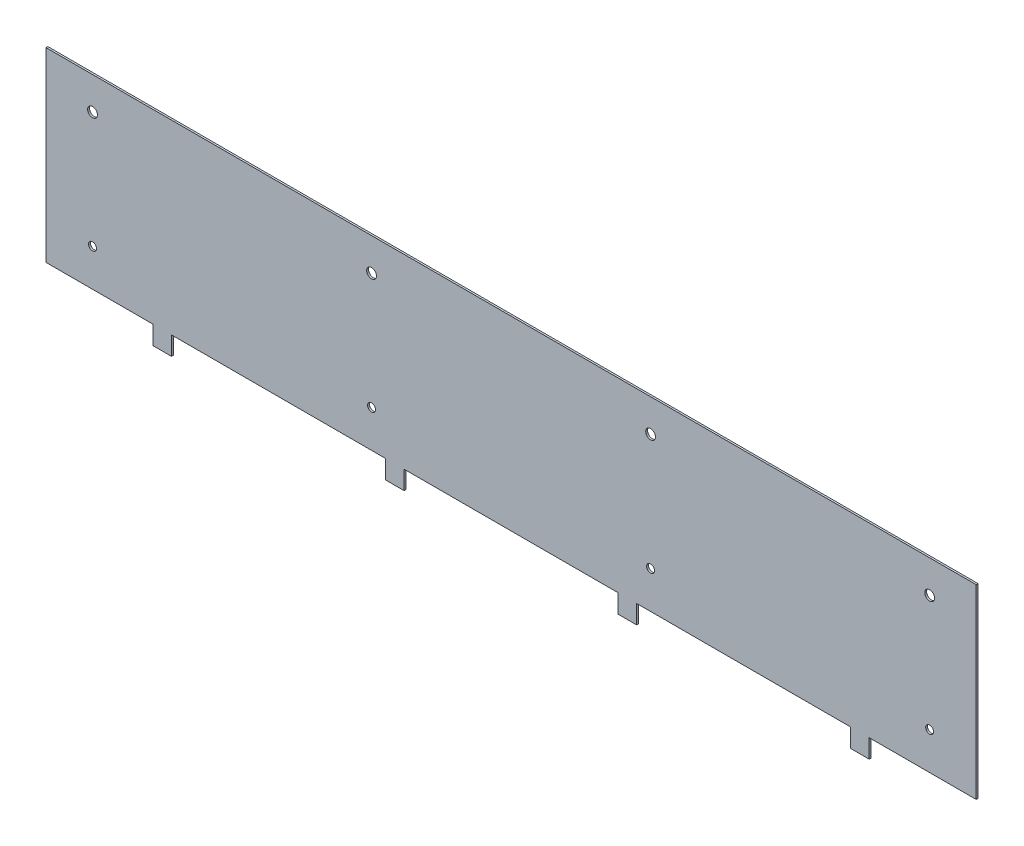
ISO-10303-21;
HEADER;
FILE_DESCRIPTION(('STEP AP214'),'2;1');
FILE_NAME('part.step','',(''),(''),'','','');
FILE_SCHEMA(('AUTOMOTIVE_DESIGN { 1 0 10303 214 1 1 1 1 }'));
ENDSEC;
DATA;
#1=APPLICATION_CONTEXT('core data for automotive mechanical design processes');
#2=APPLICATION_PROTOCOL_DEFINITION('international standard','automotive_design',2000,#1);
#3=PRODUCT_CONTEXT('',#1,'mechanical');
#4=PRODUCT('Part','Part','',(#3));
#5=PRODUCT_RELATED_PRODUCT_CATEGORY('part','',(#4));
#6=PRODUCT_DEFINITION_FORMATION('','',#4);
#7=PRODUCT_DEFINITION_CONTEXT('part definition',#1,'design');
#8=PRODUCT_DEFINITION('design','',#6,#7);
#9=PRODUCT_DEFINITION_SHAPE('','',#8);
#10=(LENGTH_UNIT() NAMED_UNIT(*) SI_UNIT(.MILLI.,.METRE.));
#11=(NAMED_UNIT(*) PLANE_ANGLE_UNIT() SI_UNIT($,.RADIAN.));
#12=(NAMED_UNIT(*) SI_UNIT($,.STERADIAN.) SOLID_ANGLE_UNIT());
#13=UNCERTAINTY_MEASURE_WITH_UNIT(LENGTH_MEASURE(1.E-05),#10,'distance_accuracy_value','');
#14=(GEOMETRIC_REPRESENTATION_CONTEXT(3) GLOBAL_UNCERTAINTY_ASSIGNED_CONTEXT((#13)) GLOBAL_UNIT_ASSIGNED_CONTEXT((#10,
#11,#12)) REPRESENTATION_CONTEXT('',''));
#15=CARTESIAN_POINT('',(0.,0.,0.));
#16=DIRECTION('',(0.,0.,1.));
#17=DIRECTION('',(1.,0.,0.));
#18=AXIS2_PLACEMENT_3D('',#15,#16,#17);
#19=CARTESIAN_POINT('',(-500.,-100.,-2.));
#20=DIRECTION('',(0.,-1.,0.));
#21=DIRECTION('',(0.,0.,-1.));
#22=AXIS2_PLACEMENT_3D('',#19,#20,#21);
#23=PLANE('',#22);
#24=DIRECTION('',(0.,0.,-1.));
#25=VECTOR('',#24,1.);
#26=CARTESIAN_POINT('',(365.,-100.,28.2842712474619));
#27=LINE('',#26,#25);
#28=CARTESIAN_POINT('',(365.,-100.,0.));
#29=VERTEX_POINT('',#28);
#30=CARTESIAN_POINT('',(365.,-100.,-2.));
#31=VERTEX_POINT('',#30);
#32=EDGE_CURVE('E184',#29,#31,#27,.T.);
#33=ORIENTED_EDGE('',*,*,#32,.F.);
#34=DIRECTION('',(1.,0.,0.));
#35=VECTOR('',#34,1.);
#36=CARTESIAN_POINT('',(-500.,-100.,0.));
#37=LINE('',#36,#35);
#38=CARTESIAN_POINT('',(135.,-100.,0.));
#39=VERTEX_POINT('',#38);
#40=EDGE_CURVE('E266',#39,#29,#37,.T.);
#41=ORIENTED_EDGE('',*,*,#40,.F.);
#42=DIRECTION('',(0.,0.,-1.));
#43=VECTOR('',#42,1.);
#44=CARTESIAN_POINT('',(135.,-100.,28.2842712474619));
#45=LINE('',#44,#43);
#46=CARTESIAN_POINT('',(135.,-100.,-2.));
#47=VERTEX_POINT('',#46);
#48=EDGE_CURVE('E68',#39,#47,#45,.T.);
#49=ORIENTED_EDGE('',*,*,#48,.T.);
#50=DIRECTION('',(1.,0.,0.));
#51=VECTOR('',#50,1.);
#52=CARTESIAN_POINT('',(-500.,-100.,-2.));
#53=LINE('',#52,#51);
#54=EDGE_CURVE('E203',#47,#31,#53,.T.);
#55=ORIENTED_EDGE('',*,*,#54,.T.);
#56=EDGE_LOOP('',(#33,#41,#49,#55));
#57=FACE_BOUND('',#56,.T.);
#58=ADVANCED_FACE('F42',(#57),#23,.T.);
#59=DIRECTION('',(0.,0.,-1.));
#60=VECTOR('',#59,1.);
#61=CARTESIAN_POINT('',(115.,-100.,28.2842712474619));
#62=LINE('',#61,#60);
#63=CARTESIAN_POINT('',(115.,-100.,0.));
#64=VERTEX_POINT('',#63);
#65=CARTESIAN_POINT('',(115.,-100.,-2.));
#66=VERTEX_POINT('',#65);
#67=EDGE_CURVE('E410',#64,#66,#62,.T.);
#68=ORIENTED_EDGE('',*,*,#67,.F.);
#69=CARTESIAN_POINT('',(-115.,-100.,0.));
#70=VERTEX_POINT('',#69);
#71=EDGE_CURVE('E463',#70,#64,#37,.T.);
#72=ORIENTED_EDGE('',*,*,#71,.F.);
#73=DIRECTION('',(0.,0.,-1.));
#74=VECTOR('',#73,1.);
#75=CARTESIAN_POINT('',(-115.,-100.,28.2842712474619));
#76=LINE('',#75,#74);
#77=CARTESIAN_POINT('',(-115.,-100.,-2.));
#78=VERTEX_POINT('',#77);
#79=EDGE_CURVE('E378',#70,#78,#76,.T.);
#80=ORIENTED_EDGE('',*,*,#79,.T.);
#81=EDGE_CURVE('E210',#78,#66,#53,.T.);
#82=ORIENTED_EDGE('',*,*,#81,.T.);
#83=EDGE_LOOP('',(#68,#72,#80,#82));
#84=FACE_BOUND('',#83,.T.);
#85=ADVANCED_FACE('F509',(#84),#23,.T.);
#86=DIRECTION('',(0.,0.,-1.));
#87=VECTOR('',#86,1.);
#88=CARTESIAN_POINT('',(-135.,-100.,28.2842712474619));
#89=LINE('',#88,#87);
#90=CARTESIAN_POINT('',(-135.,-100.,0.));
#91=VERTEX_POINT('',#90);
#92=CARTESIAN_POINT('',(-135.,-100.,-2.));
#93=VERTEX_POINT('',#92);
#94=EDGE_CURVE('E375',#91,#93,#89,.T.);
#95=ORIENTED_EDGE('',*,*,#94,.F.);
#96=CARTESIAN_POINT('',(-365.,-100.,0.));
#97=VERTEX_POINT('',#96);
#98=EDGE_CURVE('E242',#97,#91,#37,.T.);
#99=ORIENTED_EDGE('',*,*,#98,.F.);
#100=DIRECTION('',(0.,0.,-1.));
#101=VECTOR('',#100,1.);
#102=CARTESIAN_POINT('',(-365.,-100.,28.2842712474619));
#103=LINE('',#102,#101);
#104=CARTESIAN_POINT('',(-365.,-100.,-2.));
#105=VERTEX_POINT('',#104);
#106=EDGE_CURVE('E344',#97,#105,#103,.T.);
#107=ORIENTED_EDGE('',*,*,#106,.T.);
#108=EDGE_CURVE('E216',#105,#93,#53,.T.);
#109=ORIENTED_EDGE('',*,*,#108,.T.);
#110=EDGE_LOOP('',(#95,#99,#107,#109));
#111=FACE_BOUND('',#110,.T.);
#112=ADVANCED_FACE('F478',(#111),#23,.T.);
#113=DIRECTION('',(0.,0.,-1.));
#114=VECTOR('',#113,1.);
#115=CARTESIAN_POINT('',(385.,-100.,28.2842712474619));
#116=LINE('',#115,#114);
#117=CARTESIAN_POINT('',(385.,-100.,0.));
#118=VERTEX_POINT('',#117);
#119=CARTESIAN_POINT('',(385.,-100.,-2.));
#120=VERTEX_POINT('',#119);
#121=EDGE_CURVE('E60',#118,#120,#116,.T.);
#122=ORIENTED_EDGE('',*,*,#121,.T.);
#123=CARTESIAN_POINT('',(500.,-100.,-2.));
#124=VERTEX_POINT('',#123);
#125=EDGE_CURVE('E211',#120,#124,#53,.T.);
#126=ORIENTED_EDGE('',*,*,#125,.T.);
#127=DIRECTION('',(0.,0.,1.));
#128=VECTOR('',#127,1.);
#129=CARTESIAN_POINT('',(500.,-100.,-2.));
#130=LINE('',#129,#128);
#131=CARTESIAN_POINT('',(500.,-100.,0.));
#132=VERTEX_POINT('',#131);
#133=EDGE_CURVE('E11',#124,#132,#130,.T.);
#134=ORIENTED_EDGE('',*,*,#133,.T.);
#135=EDGE_CURVE('E237',#118,#132,#37,.T.);
#136=ORIENTED_EDGE('',*,*,#135,.F.);
#137=EDGE_LOOP('',(#122,#126,#134,#136));
#138=FACE_BOUND('',#137,.T.);
#139=ADVANCED_FACE('F267',(#138),#23,.T.);
#140=CARTESIAN_POINT('',(500.,-100.,-2.));
#141=DIRECTION('',(1.,0.,0.));
#142=DIRECTION('',(0.,0.,-1.));
#143=AXIS2_PLACEMENT_3D('',#140,#141,#142);
#144=PLANE('',#143);
#145=DIRECTION('',(0.,1.,0.));
#146=VECTOR('',#145,1.);
#147=CARTESIAN_POINT('',(500.,-100.,0.));
#148=LINE('',#147,#146);
#149=CARTESIAN_POINT('',(500.,100.,0.));
#150=VERTEX_POINT('',#149);
#151=EDGE_CURVE('E224',#132,#150,#148,.T.);
#152=ORIENTED_EDGE('',*,*,#151,.F.);
#153=ORIENTED_EDGE('',*,*,#133,.F.);
#154=DIRECTION('',(0.,1.,0.));
#155=VECTOR('',#154,1.);
#156=CARTESIAN_POINT('',(500.,-100.,-2.));
#157=LINE('',#156,#155);
#158=CARTESIAN_POINT('',(500.,100.,-2.));
#159=VERTEX_POINT('',#158);
#160=EDGE_CURVE('E241',#124,#159,#157,.T.);
#161=ORIENTED_EDGE('',*,*,#160,.T.);
#162=DIRECTION('',(0.,0.,1.));
#163=VECTOR('',#162,1.);
#164=CARTESIAN_POINT('',(500.,100.,-2.));
#165=LINE('',#164,#163);
#166=EDGE_CURVE('E46',#159,#150,#165,.T.);
#167=ORIENTED_EDGE('',*,*,#166,.T.);
#168=EDGE_LOOP('',(#152,#153,#161,#167));
#169=FACE_BOUND('',#168,.T.);
#170=ADVANCED_FACE('F44',(#169),#144,.T.);
#171=DIRECTION('',(0.,0.,-1.));
#172=VECTOR('',#171,1.);
#173=CARTESIAN_POINT('',(-385.,-100.,28.2842712474619));
#174=LINE('',#173,#172);
#175=CARTESIAN_POINT('',(-385.,-100.,0.));
#176=VERTEX_POINT('',#175);
#177=CARTESIAN_POINT('',(-385.,-100.,-2.));
#178=VERTEX_POINT('',#177);
#179=EDGE_CURVE('E340',#176,#178,#174,.T.);
#180=ORIENTED_EDGE('',*,*,#179,.F.);
#181=CARTESIAN_POINT('',(-500.,-100.,0.));
#182=VERTEX_POINT('',#181);
#183=EDGE_CURVE('E238',#182,#176,#37,.T.);
#184=ORIENTED_EDGE('',*,*,#183,.F.);
#185=DIRECTION('',(0.,0.,1.));
#186=VECTOR('',#185,1.);
#187=CARTESIAN_POINT('',(-500.,-100.,-2.));
#188=LINE('',#187,#186);
#189=CARTESIAN_POINT('',(-500.,-100.,-2.));
#190=VERTEX_POINT('',#189);
#191=EDGE_CURVE('E52',#190,#182,#188,.T.);
#192=ORIENTED_EDGE('',*,*,#191,.F.);
#193=EDGE_CURVE('E219',#190,#178,#53,.T.);
#194=ORIENTED_EDGE('',*,*,#193,.T.);
#195=EDGE_LOOP('',(#180,#184,#192,#194));
#196=FACE_BOUND('',#195,.T.);
#197=ADVANCED_FACE('F498',(#196),#23,.T.);
#198=CARTESIAN_POINT('',(-500.,-100.,-2.));
#199=DIRECTION('',(-1.,0.,0.));
#200=DIRECTION('',(0.,0.,1.));
#201=AXIS2_PLACEMENT_3D('',#198,#199,#200);
#202=PLANE('',#201);
#203=DIRECTION('',(0.,-1.,0.));
#204=VECTOR('',#203,1.);
#205=CARTESIAN_POINT('',(-500.,-100.,0.));
#206=LINE('',#205,#204);
#207=CARTESIAN_POINT('',(-500.,100.,0.));
#208=VERTEX_POINT('',#207);
#209=EDGE_CURVE('E233',#208,#182,#206,.T.);
#210=ORIENTED_EDGE('',*,*,#209,.F.);
#211=DIRECTION('',(0.,0.,1.));
#212=VECTOR('',#211,1.);
#213=CARTESIAN_POINT('',(-500.,100.,-2.));
#214=LINE('',#213,#212);
#215=CARTESIAN_POINT('',(-500.,100.,-2.));
#216=VERTEX_POINT('',#215);
#217=EDGE_CURVE('E245',#216,#208,#214,.T.);
#218=ORIENTED_EDGE('',*,*,#217,.F.);
#219=DIRECTION('',(0.,-1.,0.));
#220=VECTOR('',#219,1.);
#221=CARTESIAN_POINT('',(-500.,-100.,-2.));
#222=LINE('',#221,#220);
#223=EDGE_CURVE('E218',#216,#190,#222,.T.);
#224=ORIENTED_EDGE('',*,*,#223,.T.);
#225=ORIENTED_EDGE('',*,*,#191,.T.);
#226=EDGE_LOOP('',(#210,#218,#224,#225));
#227=FACE_BOUND('',#226,.T.);
#228=ADVANCED_FACE('F500',(#227),#202,.T.);
#229=CARTESIAN_POINT('',(-500.,100.,-2.));
#230=DIRECTION('',(0.,1.,0.));
#231=DIRECTION('',(0.,0.,1.));
#232=AXIS2_PLACEMENT_3D('',#229,#230,#231);
#233=PLANE('',#232);
#234=DIRECTION('',(-1.,0.,0.));
#235=VECTOR('',#234,1.);
#236=CARTESIAN_POINT('',(-500.,100.,0.));
#237=LINE('',#236,#235);
#238=EDGE_CURVE('E228',#150,#208,#237,.T.);
#239=ORIENTED_EDGE('',*,*,#238,.F.);
#240=ORIENTED_EDGE('',*,*,#166,.F.);
#241=DIRECTION('',(-1.,0.,0.));
#242=VECTOR('',#241,1.);
#243=CARTESIAN_POINT('',(-500.,100.,-2.));
#244=LINE('',#243,#242);
#245=EDGE_CURVE('E270',#159,#216,#244,.T.);
#246=ORIENTED_EDGE('',*,*,#245,.T.);
#247=ORIENTED_EDGE('',*,*,#217,.T.);
#248=EDGE_LOOP('',(#239,#240,#246,#247));
#249=FACE_BOUND('',#248,.T.);
#250=ADVANCED_FACE('F260',(#249),#233,.T.);
#251=CARTESIAN_POINT('',(0.,0.,-2.));
#252=DIRECTION('',(0.,0.,-1.));
#253=DIRECTION('',(-1.,0.,0.));
#254=AXIS2_PLACEMENT_3D('',#251,#252,#253);
#255=PLANE('',#254);
#256=CARTESIAN_POINT('',(150.,65.,-2.));
#257=DIRECTION('',(0.,0.,1.));
#258=DIRECTION('',(1.,0.,0.));
#259=AXIS2_PLACEMENT_3D('',#256,#257,#258);
#260=CIRCLE('',#259,5.25);
#261=CARTESIAN_POINT('',(155.25,65.,-2.));
#262=VERTEX_POINT('',#261);
#263=EDGE_CURVE('E304',#262,#262,#260,.T.);
#264=ORIENTED_EDGE('',*,*,#263,.T.);
#265=EDGE_LOOP('',(#264));
#266=FACE_BOUND('',#265,.T.);
#267=CARTESIAN_POINT('',(-150.,-60.,-2.));
#268=DIRECTION('',(0.,0.,1.));
#269=DIRECTION('',(1.,0.,0.));
#270=AXIS2_PLACEMENT_3D('',#267,#268,#269);
#271=CIRCLE('',#270,4.24999999999995);
#272=CARTESIAN_POINT('',(-145.75,-60.,-2.));
#273=VERTEX_POINT('',#272);
#274=EDGE_CURVE('E289',#273,#273,#271,.T.);
#275=ORIENTED_EDGE('',*,*,#274,.T.);
#276=EDGE_LOOP('',(#275));
#277=FACE_BOUND('',#276,.T.);
#278=CARTESIAN_POINT('',(-150.,65.,-2.));
#279=DIRECTION('',(0.,0.,1.));
#280=DIRECTION('',(1.,0.,0.));
#281=AXIS2_PLACEMENT_3D('',#278,#279,#280);
#282=CIRCLE('',#281,5.25);
#283=CARTESIAN_POINT('',(-144.75,65.,-2.));
#284=VERTEX_POINT('',#283);
#285=EDGE_CURVE('E288',#284,#284,#282,.T.);
#286=ORIENTED_EDGE('',*,*,#285,.T.);
#287=EDGE_LOOP('',(#286));
#288=FACE_BOUND('',#287,.T.);
#289=CARTESIAN_POINT('',(-450.,-60.,-2.));
#290=DIRECTION('',(0.,0.,1.));
#291=DIRECTION('',(1.,0.,0.));
#292=AXIS2_PLACEMENT_3D('',#289,#290,#291);
#293=CIRCLE('',#292,4.24999999999995);
#294=CARTESIAN_POINT('',(-445.75,-60.,-2.));
#295=VERTEX_POINT('',#294);
#296=EDGE_CURVE('E280',#295,#295,#293,.T.);
#297=ORIENTED_EDGE('',*,*,#296,.T.);
#298=EDGE_LOOP('',(#297));
#299=FACE_BOUND('',#298,.T.);
#300=CARTESIAN_POINT('',(450.,-60.,-2.));
#301=DIRECTION('',(0.,0.,1.));
#302=DIRECTION('',(1.,0.,0.));
#303=AXIS2_PLACEMENT_3D('',#300,#301,#302);
#304=CIRCLE('',#303,4.24999999999995);
#305=CARTESIAN_POINT('',(454.25,-60.,-2.));
#306=VERTEX_POINT('',#305);
#307=EDGE_CURVE('E321',#306,#306,#304,.T.);
#308=ORIENTED_EDGE('',*,*,#307,.T.);
#309=EDGE_LOOP('',(#308));
#310=FACE_BOUND('',#309,.T.);
#311=CARTESIAN_POINT('',(450.,65.,-2.));
#312=DIRECTION('',(0.,0.,1.));
#313=DIRECTION('',(1.,0.,0.));
#314=AXIS2_PLACEMENT_3D('',#311,#312,#313);
#315=CIRCLE('',#314,5.25);
#316=CARTESIAN_POINT('',(455.25,65.,-2.));
#317=VERTEX_POINT('',#316);
#318=EDGE_CURVE('E320',#317,#317,#315,.T.);
#319=ORIENTED_EDGE('',*,*,#318,.T.);
#320=EDGE_LOOP('',(#319));
#321=FACE_BOUND('',#320,.T.);
#322=CARTESIAN_POINT('',(150.,-60.,-2.));
#323=DIRECTION('',(0.,0.,1.));
#324=DIRECTION('',(1.,0.,0.));
#325=AXIS2_PLACEMENT_3D('',#322,#323,#324);
#326=CIRCLE('',#325,4.24999999999995);
#327=CARTESIAN_POINT('',(154.25,-60.,-2.));
#328=VERTEX_POINT('',#327);
#329=EDGE_CURVE('E305',#328,#328,#326,.T.);
#330=ORIENTED_EDGE('',*,*,#329,.T.);
#331=EDGE_LOOP('',(#330));
#332=FACE_BOUND('',#331,.T.);
#333=CARTESIAN_POINT('',(-450.,65.,-2.));
#334=DIRECTION('',(0.,0.,1.));
#335=DIRECTION('',(1.,0.,0.));
#336=AXIS2_PLACEMENT_3D('',#333,#334,#335);
#337=CIRCLE('',#336,5.25);
#338=CARTESIAN_POINT('',(-444.75,65.,-2.));
#339=VERTEX_POINT('',#338);
#340=EDGE_CURVE('E229',#339,#339,#337,.T.);
#341=ORIENTED_EDGE('',*,*,#340,.T.);
#342=EDGE_LOOP('',(#341));
#343=FACE_BOUND('',#342,.T.);
#344=ORIENTED_EDGE('',*,*,#160,.F.);
#345=ORIENTED_EDGE('',*,*,#125,.F.);
#346=DIRECTION('',(0.,-1.,0.));
#347=VECTOR('',#346,1.);
#348=CARTESIAN_POINT('',(385.,-100.,-2.));
#349=LINE('',#348,#347);
#350=CARTESIAN_POINT('',(385.,-120.,-2.));
#351=VERTEX_POINT('',#350);
#352=EDGE_CURVE('E207',#120,#351,#349,.T.);
#353=ORIENTED_EDGE('',*,*,#352,.T.);
#354=DIRECTION('',(-1.,0.,0.));
#355=VECTOR('',#354,1.);
#356=CARTESIAN_POINT('',(365.,-120.,-2.));
#357=LINE('',#356,#355);
#358=CARTESIAN_POINT('',(365.,-120.,-2.));
#359=VERTEX_POINT('',#358);
#360=EDGE_CURVE('E196',#351,#359,#357,.T.);
#361=ORIENTED_EDGE('',*,*,#360,.T.);
#362=DIRECTION('',(0.,1.,0.));
#363=VECTOR('',#362,1.);
#364=CARTESIAN_POINT('',(365.,-100.,-2.));
#365=LINE('',#364,#363);
#366=EDGE_CURVE('E188',#359,#31,#365,.T.);
#367=ORIENTED_EDGE('',*,*,#366,.T.);
#368=ORIENTED_EDGE('',*,*,#54,.F.);
#369=DIRECTION('',(0.,-1.,0.));
#370=VECTOR('',#369,1.);
#371=CARTESIAN_POINT('',(135.,-100.,-2.));
#372=LINE('',#371,#370);
#373=CARTESIAN_POINT('',(135.,-120.,-2.));
#374=VERTEX_POINT('',#373);
#375=EDGE_CURVE('E426',#47,#374,#372,.T.);
#376=ORIENTED_EDGE('',*,*,#375,.T.);
#377=DIRECTION('',(-1.,0.,0.));
#378=VECTOR('',#377,1.);
#379=CARTESIAN_POINT('',(115.,-120.,-2.));
#380=LINE('',#379,#378);
#381=CARTESIAN_POINT('',(115.,-120.,-2.));
#382=VERTEX_POINT('',#381);
#383=EDGE_CURVE('E413',#374,#382,#380,.T.);
#384=ORIENTED_EDGE('',*,*,#383,.T.);
#385=DIRECTION('',(0.,1.,0.));
#386=VECTOR('',#385,1.);
#387=CARTESIAN_POINT('',(115.,-100.,-2.));
#388=LINE('',#387,#386);
#389=EDGE_CURVE('E429',#382,#66,#388,.T.);
#390=ORIENTED_EDGE('',*,*,#389,.T.);
#391=ORIENTED_EDGE('',*,*,#81,.F.);
#392=DIRECTION('',(0.,-1.,0.));
#393=VECTOR('',#392,1.);
#394=CARTESIAN_POINT('',(-115.,-100.,-2.));
#395=LINE('',#394,#393);
#396=CARTESIAN_POINT('',(-115.,-120.,-2.));
#397=VERTEX_POINT('',#396);
#398=EDGE_CURVE('E393',#78,#397,#395,.T.);
#399=ORIENTED_EDGE('',*,*,#398,.T.);
#400=DIRECTION('',(-1.,0.,0.));
#401=VECTOR('',#400,1.);
#402=CARTESIAN_POINT('',(-135.,-120.,-2.));
#403=LINE('',#402,#401);
#404=CARTESIAN_POINT('',(-135.,-120.,-2.));
#405=VERTEX_POINT('',#404);
#406=EDGE_CURVE('E379',#397,#405,#403,.T.);
#407=ORIENTED_EDGE('',*,*,#406,.T.);
#408=DIRECTION('',(0.,1.,0.));
#409=VECTOR('',#408,1.);
#410=CARTESIAN_POINT('',(-135.,-100.,-2.));
#411=LINE('',#410,#409);
#412=EDGE_CURVE('E397',#405,#93,#411,.T.);
#413=ORIENTED_EDGE('',*,*,#412,.T.);
#414=ORIENTED_EDGE('',*,*,#108,.F.);
#415=DIRECTION('',(0.,-1.,0.));
#416=VECTOR('',#415,1.);
#417=CARTESIAN_POINT('',(-365.,-100.,-2.));
#418=LINE('',#417,#416);
#419=CARTESIAN_POINT('',(-365.,-120.,-2.));
#420=VERTEX_POINT('',#419);
#421=EDGE_CURVE('E358',#105,#420,#418,.T.);
#422=ORIENTED_EDGE('',*,*,#421,.T.);
#423=DIRECTION('',(-1.,0.,0.));
#424=VECTOR('',#423,1.);
#425=CARTESIAN_POINT('',(-385.,-120.,-2.));
#426=LINE('',#425,#424);
#427=CARTESIAN_POINT('',(-385.,-120.,-2.));
#428=VERTEX_POINT('',#427);
#429=EDGE_CURVE('E345',#420,#428,#426,.T.);
#430=ORIENTED_EDGE('',*,*,#429,.T.);
#431=DIRECTION('',(0.,1.,0.));
#432=VECTOR('',#431,1.);
#433=CARTESIAN_POINT('',(-385.,-100.,-2.));
#434=LINE('',#433,#432);
#435=EDGE_CURVE('E362',#428,#178,#434,.T.);
#436=ORIENTED_EDGE('',*,*,#435,.T.);
#437=ORIENTED_EDGE('',*,*,#193,.F.);
#438=ORIENTED_EDGE('',*,*,#223,.F.);
#439=ORIENTED_EDGE('',*,*,#245,.F.);
#440=EDGE_LOOP('',(#344,#345,#353,#361,#367,#368,#376,#384,#390,#391,#399,#407,#413,#414,#422,
#430,#436,#437,#438,#439));
#441=FACE_BOUND('',#440,.T.);
#442=ADVANCED_FACE('F201',(#266,#277,#288,#299,#310,#321,#332,#343,#441),#255,.T.);
#443=CARTESIAN_POINT('',(0.,0.,0.));
#444=DIRECTION('',(0.,0.,-1.));
#445=DIRECTION('',(-1.,0.,0.));
#446=AXIS2_PLACEMENT_3D('',#443,#444,#445);
#447=PLANE('',#446);
#448=CARTESIAN_POINT('',(150.,65.,0.));
#449=DIRECTION('',(0.,0.,1.));
#450=DIRECTION('',(1.,0.,0.));
#451=AXIS2_PLACEMENT_3D('',#448,#449,#450);
#452=CIRCLE('',#451,5.25);
#453=CARTESIAN_POINT('',(155.25,65.,0.));
#454=VERTEX_POINT('',#453);
#455=EDGE_CURVE('E300',#454,#454,#452,.T.);
#456=ORIENTED_EDGE('',*,*,#455,.F.);
#457=EDGE_LOOP('',(#456));
#458=FACE_BOUND('',#457,.T.);
#459=CARTESIAN_POINT('',(-150.,-60.,0.));
#460=DIRECTION('',(0.,0.,1.));
#461=DIRECTION('',(1.,0.,0.));
#462=AXIS2_PLACEMENT_3D('',#459,#460,#461);
#463=CIRCLE('',#462,4.24999999999995);
#464=CARTESIAN_POINT('',(-145.75,-60.,0.));
#465=VERTEX_POINT('',#464);
#466=EDGE_CURVE('E309',#465,#465,#463,.T.);
#467=ORIENTED_EDGE('',*,*,#466,.F.);
#468=EDGE_LOOP('',(#467));
#469=FACE_BOUND('',#468,.T.);
#470=CARTESIAN_POINT('',(-150.,65.,0.));
#471=DIRECTION('',(0.,0.,1.));
#472=DIRECTION('',(1.,0.,0.));
#473=AXIS2_PLACEMENT_3D('',#470,#471,#472);
#474=CIRCLE('',#473,5.25);
#475=CARTESIAN_POINT('',(-144.75,65.,0.));
#476=VERTEX_POINT('',#475);
#477=EDGE_CURVE('E284',#476,#476,#474,.T.);
#478=ORIENTED_EDGE('',*,*,#477,.F.);
#479=EDGE_LOOP('',(#478));
#480=FACE_BOUND('',#479,.T.);
#481=CARTESIAN_POINT('',(-450.,-60.,0.));
#482=DIRECTION('',(0.,0.,1.));
#483=DIRECTION('',(1.,0.,0.));
#484=AXIS2_PLACEMENT_3D('',#481,#482,#483);
#485=CIRCLE('',#484,4.24999999999995);
#486=CARTESIAN_POINT('',(-445.75,-60.,0.));
#487=VERTEX_POINT('',#486);
#488=EDGE_CURVE('E293',#487,#487,#485,.T.);
#489=ORIENTED_EDGE('',*,*,#488,.F.);
#490=EDGE_LOOP('',(#489));
#491=FACE_BOUND('',#490,.T.);
#492=CARTESIAN_POINT('',(450.,-60.,0.));
#493=DIRECTION('',(0.,0.,1.));
#494=DIRECTION('',(1.,0.,0.));
#495=AXIS2_PLACEMENT_3D('',#492,#493,#494);
#496=CIRCLE('',#495,4.24999999999995);
#497=CARTESIAN_POINT('',(454.25,-60.,0.));
#498=VERTEX_POINT('',#497);
#499=EDGE_CURVE('E332',#498,#498,#496,.T.);
#500=ORIENTED_EDGE('',*,*,#499,.F.);
#501=EDGE_LOOP('',(#500));
#502=FACE_BOUND('',#501,.T.);
#503=CARTESIAN_POINT('',(450.,65.,0.));
#504=DIRECTION('',(0.,0.,1.));
#505=DIRECTION('',(1.,0.,0.));
#506=AXIS2_PLACEMENT_3D('',#503,#504,#505);
#507=CIRCLE('',#506,5.25);
#508=CARTESIAN_POINT('',(455.25,65.,0.));
#509=VERTEX_POINT('',#508);
#510=EDGE_CURVE('E316',#509,#509,#507,.T.);
#511=ORIENTED_EDGE('',*,*,#510,.F.);
#512=EDGE_LOOP('',(#511));
#513=FACE_BOUND('',#512,.T.);
#514=CARTESIAN_POINT('',(150.,-60.,0.));
#515=DIRECTION('',(0.,0.,1.));
#516=DIRECTION('',(1.,0.,0.));
#517=AXIS2_PLACEMENT_3D('',#514,#515,#516);
#518=CIRCLE('',#517,4.24999999999995);
#519=CARTESIAN_POINT('',(154.25,-60.,0.));
#520=VERTEX_POINT('',#519);
#521=EDGE_CURVE('E325',#520,#520,#518,.T.);
#522=ORIENTED_EDGE('',*,*,#521,.F.);
#523=EDGE_LOOP('',(#522));
#524=FACE_BOUND('',#523,.T.);
#525=CARTESIAN_POINT('',(-450.,65.,0.));
#526=DIRECTION('',(0.,0.,1.));
#527=DIRECTION('',(1.,0.,0.));
#528=AXIS2_PLACEMENT_3D('',#525,#526,#527);
#529=CIRCLE('',#528,5.25);
#530=CARTESIAN_POINT('',(-444.75,65.,0.));
#531=VERTEX_POINT('',#530);
#532=EDGE_CURVE('E276',#531,#531,#529,.T.);
#533=ORIENTED_EDGE('',*,*,#532,.F.);
#534=EDGE_LOOP('',(#533));
#535=FACE_BOUND('',#534,.T.);
#536=ORIENTED_EDGE('',*,*,#151,.T.);
#537=ORIENTED_EDGE('',*,*,#238,.T.);
#538=ORIENTED_EDGE('',*,*,#209,.T.);
#539=ORIENTED_EDGE('',*,*,#183,.T.);
#540=DIRECTION('',(0.,-1.,0.));
#541=VECTOR('',#540,1.);
#542=CARTESIAN_POINT('',(-385.,-100.,0.));
#543=LINE('',#542,#541);
#544=CARTESIAN_POINT('',(-385.,-120.,0.));
#545=VERTEX_POINT('',#544);
#546=EDGE_CURVE('E336',#176,#545,#543,.T.);
#547=ORIENTED_EDGE('',*,*,#546,.T.);
#548=DIRECTION('',(1.,0.,0.));
#549=VECTOR('',#548,1.);
#550=CARTESIAN_POINT('',(-385.,-120.,0.));
#551=LINE('',#550,#549);
#552=CARTESIAN_POINT('',(-365.,-120.,0.));
#553=VERTEX_POINT('',#552);
#554=EDGE_CURVE('E369',#545,#553,#551,.T.);
#555=ORIENTED_EDGE('',*,*,#554,.T.);
#556=DIRECTION('',(0.,1.,0.));
#557=VECTOR('',#556,1.);
#558=CARTESIAN_POINT('',(-365.,-100.,0.));
#559=LINE('',#558,#557);
#560=EDGE_CURVE('E354',#553,#97,#559,.T.);
#561=ORIENTED_EDGE('',*,*,#560,.T.);
#562=ORIENTED_EDGE('',*,*,#98,.T.);
#563=DIRECTION('',(0.,-1.,0.));
#564=VECTOR('',#563,1.);
#565=CARTESIAN_POINT('',(-135.,-100.,0.));
#566=LINE('',#565,#564);
#567=CARTESIAN_POINT('',(-135.,-120.,0.));
#568=VERTEX_POINT('',#567);
#569=EDGE_CURVE('E366',#91,#568,#566,.T.);
#570=ORIENTED_EDGE('',*,*,#569,.T.);
#571=DIRECTION('',(1.,0.,0.));
#572=VECTOR('',#571,1.);
#573=CARTESIAN_POINT('',(-135.,-120.,0.));
#574=LINE('',#573,#572);
#575=CARTESIAN_POINT('',(-115.,-120.,0.));
#576=VERTEX_POINT('',#575);
#577=EDGE_CURVE('E404',#568,#576,#574,.T.);
#578=ORIENTED_EDGE('',*,*,#577,.T.);
#579=DIRECTION('',(0.,1.,0.));
#580=VECTOR('',#579,1.);
#581=CARTESIAN_POINT('',(-115.,-100.,0.));
#582=LINE('',#581,#580);
#583=EDGE_CURVE('E389',#576,#70,#582,.T.);
#584=ORIENTED_EDGE('',*,*,#583,.T.);
#585=ORIENTED_EDGE('',*,*,#71,.T.);
#586=DIRECTION('',(0.,-1.,0.));
#587=VECTOR('',#586,1.);
#588=CARTESIAN_POINT('',(115.,-100.,0.));
#589=LINE('',#588,#587);
#590=CARTESIAN_POINT('',(115.,-120.,0.));
#591=VERTEX_POINT('',#590);
#592=EDGE_CURVE('E401',#64,#591,#589,.T.);
#593=ORIENTED_EDGE('',*,*,#592,.T.);
#594=DIRECTION('',(1.,0.,0.));
#595=VECTOR('',#594,1.);
#596=CARTESIAN_POINT('',(115.,-120.,0.));
#597=LINE('',#596,#595);
#598=CARTESIAN_POINT('',(135.,-120.,0.));
#599=VERTEX_POINT('',#598);
#600=EDGE_CURVE('E435',#591,#599,#597,.T.);
#601=ORIENTED_EDGE('',*,*,#600,.T.);
#602=DIRECTION('',(0.,1.,0.));
#603=VECTOR('',#602,1.);
#604=CARTESIAN_POINT('',(135.,-100.,0.));
#605=LINE('',#604,#603);
#606=EDGE_CURVE('E422',#599,#39,#605,.T.);
#607=ORIENTED_EDGE('',*,*,#606,.T.);
#608=ORIENTED_EDGE('',*,*,#40,.T.);
#609=DIRECTION('',(0.,-1.,0.));
#610=VECTOR('',#609,1.);
#611=CARTESIAN_POINT('',(365.,-100.,0.));
#612=LINE('',#611,#610);
#613=CARTESIAN_POINT('',(365.,-120.,0.));
#614=VERTEX_POINT('',#613);
#615=EDGE_CURVE('E190',#29,#614,#612,.T.);
#616=ORIENTED_EDGE('',*,*,#615,.T.);
#617=DIRECTION('',(1.,0.,0.));
#618=VECTOR('',#617,1.);
#619=CARTESIAN_POINT('',(365.,-120.,0.));
#620=LINE('',#619,#618);
#621=CARTESIAN_POINT('',(385.,-120.,0.));
#622=VERTEX_POINT('',#621);
#623=EDGE_CURVE('E454',#614,#622,#620,.T.);
#624=ORIENTED_EDGE('',*,*,#623,.T.);
#625=DIRECTION('',(0.,1.,0.));
#626=VECTOR('',#625,1.);
#627=CARTESIAN_POINT('',(385.,-100.,0.));
#628=LINE('',#627,#626);
#629=EDGE_CURVE('E264',#622,#118,#628,.T.);
#630=ORIENTED_EDGE('',*,*,#629,.T.);
#631=ORIENTED_EDGE('',*,*,#135,.T.);
#632=EDGE_LOOP('',(#536,#537,#538,#539,#547,#555,#561,#562,#570,#578,#584,#585,#593,#601,#607,
#608,#616,#624,#630,#631));
#633=FACE_BOUND('',#632,.T.);
#634=ADVANCED_FACE('F262',(#458,#469,#480,#491,#502,#513,#524,#535,#633),#447,.F.);
#635=CARTESIAN_POINT('',(-450.,65.,-2.));
#636=DIRECTION('',(0.,0.,1.));
#637=DIRECTION('',(1.,0.,0.));
#638=AXIS2_PLACEMENT_3D('',#635,#636,#637);
#639=CYLINDRICAL_SURFACE('',#638,5.25);
#640=ORIENTED_EDGE('',*,*,#340,.F.);
#641=EDGE_LOOP('',(#640));
#642=FACE_BOUND('',#641,.T.);
#643=ORIENTED_EDGE('',*,*,#532,.T.);
#644=EDGE_LOOP('',(#643));
#645=FACE_BOUND('',#644,.T.);
#646=ADVANCED_FACE('F517',(#642,#645),#639,.F.);
#647=CARTESIAN_POINT('',(150.,-60.,-2.));
#648=DIRECTION('',(0.,0.,1.));
#649=DIRECTION('',(1.,0.,0.));
#650=AXIS2_PLACEMENT_3D('',#647,#648,#649);
#651=CYLINDRICAL_SURFACE('',#650,4.24999999999995);
#652=ORIENTED_EDGE('',*,*,#329,.F.);
#653=EDGE_LOOP('',(#652));
#654=FACE_BOUND('',#653,.T.);
#655=ORIENTED_EDGE('',*,*,#521,.T.);
#656=EDGE_LOOP('',(#655));
#657=FACE_BOUND('',#656,.T.);
#658=ADVANCED_FACE('F524',(#654,#657),#651,.F.);
#659=CARTESIAN_POINT('',(450.,65.,-2.));
#660=DIRECTION('',(0.,0.,1.));
#661=DIRECTION('',(1.,0.,0.));
#662=AXIS2_PLACEMENT_3D('',#659,#660,#661);
#663=CYLINDRICAL_SURFACE('',#662,5.25);
#664=ORIENTED_EDGE('',*,*,#318,.F.);
#665=EDGE_LOOP('',(#664));
#666=FACE_BOUND('',#665,.T.);
#667=ORIENTED_EDGE('',*,*,#510,.T.);
#668=EDGE_LOOP('',(#667));
#669=FACE_BOUND('',#668,.T.);
#670=ADVANCED_FACE('F543',(#666,#669),#663,.F.);
#671=CARTESIAN_POINT('',(450.,-60.,-2.));
#672=DIRECTION('',(0.,0.,1.));
#673=DIRECTION('',(1.,0.,0.));
#674=AXIS2_PLACEMENT_3D('',#671,#672,#673);
#675=CYLINDRICAL_SURFACE('',#674,4.24999999999995);
#676=ORIENTED_EDGE('',*,*,#307,.F.);
#677=EDGE_LOOP('',(#676));
#678=FACE_BOUND('',#677,.T.);
#679=ORIENTED_EDGE('',*,*,#499,.T.);
#680=EDGE_LOOP('',(#679));
#681=FACE_BOUND('',#680,.T.);
#682=ADVANCED_FACE('F534',(#678,#681),#675,.F.);
#683=CARTESIAN_POINT('',(-450.,-60.,-2.));
#684=DIRECTION('',(0.,0.,1.));
#685=DIRECTION('',(1.,0.,0.));
#686=AXIS2_PLACEMENT_3D('',#683,#684,#685);
#687=CYLINDRICAL_SURFACE('',#686,4.24999999999995);
#688=ORIENTED_EDGE('',*,*,#296,.F.);
#689=EDGE_LOOP('',(#688));
#690=FACE_BOUND('',#689,.T.);
#691=ORIENTED_EDGE('',*,*,#488,.T.);
#692=EDGE_LOOP('',(#691));
#693=FACE_BOUND('',#692,.T.);
#694=ADVANCED_FACE('F530',(#690,#693),#687,.F.);
#695=CARTESIAN_POINT('',(-150.,65.,-2.));
#696=DIRECTION('',(0.,0.,1.));
#697=DIRECTION('',(1.,0.,0.));
#698=AXIS2_PLACEMENT_3D('',#695,#696,#697);
#699=CYLINDRICAL_SURFACE('',#698,5.25);
#700=ORIENTED_EDGE('',*,*,#285,.F.);
#701=EDGE_LOOP('',(#700));
#702=FACE_BOUND('',#701,.T.);
#703=ORIENTED_EDGE('',*,*,#477,.T.);
#704=EDGE_LOOP('',(#703));
#705=FACE_BOUND('',#704,.T.);
#706=ADVANCED_FACE('F526',(#702,#705),#699,.F.);
#707=CARTESIAN_POINT('',(-150.,-60.,-2.));
#708=DIRECTION('',(0.,0.,1.));
#709=DIRECTION('',(1.,0.,0.));
#710=AXIS2_PLACEMENT_3D('',#707,#708,#709);
#711=CYLINDRICAL_SURFACE('',#710,4.24999999999995);
#712=ORIENTED_EDGE('',*,*,#274,.F.);
#713=EDGE_LOOP('',(#712));
#714=FACE_BOUND('',#713,.T.);
#715=ORIENTED_EDGE('',*,*,#466,.T.);
#716=EDGE_LOOP('',(#715));
#717=FACE_BOUND('',#716,.T.);
#718=ADVANCED_FACE('F529',(#714,#717),#711,.F.);
#719=CARTESIAN_POINT('',(150.,65.,-2.));
#720=DIRECTION('',(0.,0.,1.));
#721=DIRECTION('',(1.,0.,0.));
#722=AXIS2_PLACEMENT_3D('',#719,#720,#721);
#723=CYLINDRICAL_SURFACE('',#722,5.25);
#724=ORIENTED_EDGE('',*,*,#263,.F.);
#725=EDGE_LOOP('',(#724));
#726=FACE_BOUND('',#725,.T.);
#727=ORIENTED_EDGE('',*,*,#455,.T.);
#728=EDGE_LOOP('',(#727));
#729=FACE_BOUND('',#728,.T.);
#730=ADVANCED_FACE('F536',(#726,#729),#723,.F.);
#731=CARTESIAN_POINT('',(-385.,-100.,28.2842712474619));
#732=DIRECTION('',(-1.,0.,0.));
#733=DIRECTION('',(0.,0.,1.));
#734=AXIS2_PLACEMENT_3D('',#731,#732,#733);
#735=PLANE('',#734);
#736=ORIENTED_EDGE('',*,*,#546,.F.);
#737=ORIENTED_EDGE('',*,*,#179,.T.);
#738=ORIENTED_EDGE('',*,*,#435,.F.);
#739=DIRECTION('',(0.,0.,-1.));
#740=VECTOR('',#739,1.);
#741=CARTESIAN_POINT('',(-385.,-120.,28.2842712474619));
#742=LINE('',#741,#740);
#743=EDGE_CURVE('E351',#545,#428,#742,.T.);
#744=ORIENTED_EDGE('',*,*,#743,.F.);
#745=EDGE_LOOP('',(#736,#737,#738,#744));
#746=FACE_BOUND('',#745,.T.);
#747=ADVANCED_FACE('F495',(#746),#735,.T.);
#748=CARTESIAN_POINT('',(-385.,-120.,28.2842712474619));
#749=DIRECTION('',(0.,-1.,0.));
#750=DIRECTION('',(0.,0.,-1.));
#751=AXIS2_PLACEMENT_3D('',#748,#749,#750);
#752=PLANE('',#751);
#753=ORIENTED_EDGE('',*,*,#554,.F.);
#754=ORIENTED_EDGE('',*,*,#743,.T.);
#755=ORIENTED_EDGE('',*,*,#429,.F.);
#756=DIRECTION('',(0.,0.,-1.));
#757=VECTOR('',#756,1.);
#758=CARTESIAN_POINT('',(-365.,-120.,28.2842712474619));
#759=LINE('',#758,#757);
#760=EDGE_CURVE('E348',#553,#420,#759,.T.);
#761=ORIENTED_EDGE('',*,*,#760,.F.);
#762=EDGE_LOOP('',(#753,#754,#755,#761));
#763=FACE_BOUND('',#762,.T.);
#764=ADVANCED_FACE('F489',(#763),#752,.T.);
#765=CARTESIAN_POINT('',(-365.,-100.,28.2842712474619));
#766=DIRECTION('',(1.,0.,0.));
#767=DIRECTION('',(0.,0.,-1.));
#768=AXIS2_PLACEMENT_3D('',#765,#766,#767);
#769=PLANE('',#768);
#770=ORIENTED_EDGE('',*,*,#560,.F.);
#771=ORIENTED_EDGE('',*,*,#760,.T.);
#772=ORIENTED_EDGE('',*,*,#421,.F.);
#773=ORIENTED_EDGE('',*,*,#106,.F.);
#774=EDGE_LOOP('',(#770,#771,#772,#773));
#775=FACE_BOUND('',#774,.T.);
#776=ADVANCED_FACE('F485',(#775),#769,.T.);
#777=CARTESIAN_POINT('',(-135.,-100.,28.2842712474619));
#778=DIRECTION('',(-1.,0.,0.));
#779=DIRECTION('',(0.,0.,1.));
#780=AXIS2_PLACEMENT_3D('',#777,#778,#779);
#781=PLANE('',#780);
#782=ORIENTED_EDGE('',*,*,#569,.F.);
#783=ORIENTED_EDGE('',*,*,#94,.T.);
#784=ORIENTED_EDGE('',*,*,#412,.F.);
#785=DIRECTION('',(0.,0.,-1.));
#786=VECTOR('',#785,1.);
#787=CARTESIAN_POINT('',(-135.,-120.,28.2842712474619));
#788=LINE('',#787,#786);
#789=EDGE_CURVE('E386',#568,#405,#788,.T.);
#790=ORIENTED_EDGE('',*,*,#789,.F.);
#791=EDGE_LOOP('',(#782,#783,#784,#790));
#792=FACE_BOUND('',#791,.T.);
#793=ADVANCED_FACE('F557',(#792),#781,.T.);
#794=CARTESIAN_POINT('',(-135.,-120.,28.2842712474619));
#795=DIRECTION('',(0.,-1.,0.));
#796=DIRECTION('',(0.,0.,-1.));
#797=AXIS2_PLACEMENT_3D('',#794,#795,#796);
#798=PLANE('',#797);
#799=ORIENTED_EDGE('',*,*,#577,.F.);
#800=ORIENTED_EDGE('',*,*,#789,.T.);
#801=ORIENTED_EDGE('',*,*,#406,.F.);
#802=DIRECTION('',(0.,0.,-1.));
#803=VECTOR('',#802,1.);
#804=CARTESIAN_POINT('',(-115.,-120.,28.2842712474619));
#805=LINE('',#804,#803);
#806=EDGE_CURVE('E383',#576,#397,#805,.T.);
#807=ORIENTED_EDGE('',*,*,#806,.F.);
#808=EDGE_LOOP('',(#799,#800,#801,#807));
#809=FACE_BOUND('',#808,.T.);
#810=ADVANCED_FACE('F562',(#809),#798,.T.);
#811=CARTESIAN_POINT('',(-115.,-100.,28.2842712474619));
#812=DIRECTION('',(1.,0.,0.));
#813=DIRECTION('',(0.,0.,-1.));
#814=AXIS2_PLACEMENT_3D('',#811,#812,#813);
#815=PLANE('',#814);
#816=ORIENTED_EDGE('',*,*,#583,.F.);
#817=ORIENTED_EDGE('',*,*,#806,.T.);
#818=ORIENTED_EDGE('',*,*,#398,.F.);
#819=ORIENTED_EDGE('',*,*,#79,.F.);
#820=EDGE_LOOP('',(#816,#817,#818,#819));
#821=FACE_BOUND('',#820,.T.);
#822=ADVANCED_FACE('F564',(#821),#815,.T.);
#823=CARTESIAN_POINT('',(115.,-100.,28.2842712474619));
#824=DIRECTION('',(-1.,0.,0.));
#825=DIRECTION('',(0.,0.,1.));
#826=AXIS2_PLACEMENT_3D('',#823,#824,#825);
#827=PLANE('',#826);
#828=ORIENTED_EDGE('',*,*,#592,.F.);
#829=ORIENTED_EDGE('',*,*,#67,.T.);
#830=ORIENTED_EDGE('',*,*,#389,.F.);
#831=DIRECTION('',(0.,0.,-1.));
#832=VECTOR('',#831,1.);
#833=CARTESIAN_POINT('',(115.,-120.,28.2842712474619));
#834=LINE('',#833,#832);
#835=EDGE_CURVE('E419',#591,#382,#834,.T.);
#836=ORIENTED_EDGE('',*,*,#835,.F.);
#837=EDGE_LOOP('',(#828,#829,#830,#836));
#838=FACE_BOUND('',#837,.T.);
#839=ADVANCED_FACE('F567',(#838),#827,.T.);
#840=CARTESIAN_POINT('',(115.,-120.,28.2842712474619));
#841=DIRECTION('',(0.,-1.,0.));
#842=DIRECTION('',(0.,0.,-1.));
#843=AXIS2_PLACEMENT_3D('',#840,#841,#842);
#844=PLANE('',#843);
#845=ORIENTED_EDGE('',*,*,#600,.F.);
#846=ORIENTED_EDGE('',*,*,#835,.T.);
#847=ORIENTED_EDGE('',*,*,#383,.F.);
#848=DIRECTION('',(0.,0.,-1.));
#849=VECTOR('',#848,1.);
#850=CARTESIAN_POINT('',(135.,-120.,28.2842712474619));
#851=LINE('',#850,#849);
#852=EDGE_CURVE('E416',#599,#374,#851,.T.);
#853=ORIENTED_EDGE('',*,*,#852,.F.);
#854=EDGE_LOOP('',(#845,#846,#847,#853));
#855=FACE_BOUND('',#854,.T.);
#856=ADVANCED_FACE('F574',(#855),#844,.T.);
#857=CARTESIAN_POINT('',(135.,-100.,28.2842712474619));
#858=DIRECTION('',(1.,0.,0.));
#859=DIRECTION('',(0.,0.,-1.));
#860=AXIS2_PLACEMENT_3D('',#857,#858,#859);
#861=PLANE('',#860);
#862=ORIENTED_EDGE('',*,*,#606,.F.);
#863=ORIENTED_EDGE('',*,*,#852,.T.);
#864=ORIENTED_EDGE('',*,*,#375,.F.);
#865=ORIENTED_EDGE('',*,*,#48,.F.);
#866=EDGE_LOOP('',(#862,#863,#864,#865));
#867=FACE_BOUND('',#866,.T.);
#868=ADVANCED_FACE('F576',(#867),#861,.T.);
#869=CARTESIAN_POINT('',(365.,-100.,28.2842712474619));
#870=DIRECTION('',(-1.,0.,0.));
#871=DIRECTION('',(0.,0.,1.));
#872=AXIS2_PLACEMENT_3D('',#869,#870,#871);
#873=PLANE('',#872);
#874=ORIENTED_EDGE('',*,*,#615,.F.);
#875=ORIENTED_EDGE('',*,*,#32,.T.);
#876=ORIENTED_EDGE('',*,*,#366,.F.);
#877=DIRECTION('',(0.,0.,-1.));
#878=VECTOR('',#877,1.);
#879=CARTESIAN_POINT('',(365.,-120.,28.2842712474619));
#880=LINE('',#879,#878);
#881=EDGE_CURVE('E445',#614,#359,#880,.T.);
#882=ORIENTED_EDGE('',*,*,#881,.F.);
#883=EDGE_LOOP('',(#874,#875,#876,#882));
#884=FACE_BOUND('',#883,.T.);
#885=ADVANCED_FACE('F186',(#884),#873,.T.);
#886=CARTESIAN_POINT('',(365.,-120.,28.2842712474619));
#887=DIRECTION('',(0.,-1.,0.));
#888=DIRECTION('',(0.,0.,-1.));
#889=AXIS2_PLACEMENT_3D('',#886,#887,#888);
#890=PLANE('',#889);
#891=ORIENTED_EDGE('',*,*,#623,.F.);
#892=ORIENTED_EDGE('',*,*,#881,.T.);
#893=ORIENTED_EDGE('',*,*,#360,.F.);
#894=DIRECTION('',(0.,0.,-1.));
#895=VECTOR('',#894,1.);
#896=CARTESIAN_POINT('',(385.,-120.,28.2842712474619));
#897=LINE('',#896,#895);
#898=EDGE_CURVE('E442',#622,#351,#897,.T.);
#899=ORIENTED_EDGE('',*,*,#898,.F.);
#900=EDGE_LOOP('',(#891,#892,#893,#899));
#901=FACE_BOUND('',#900,.T.);
#902=ADVANCED_FACE('F584',(#901),#890,.T.);
#903=CARTESIAN_POINT('',(385.,-100.,28.2842712474619));
#904=DIRECTION('',(1.,0.,0.));
#905=DIRECTION('',(0.,0.,-1.));
#906=AXIS2_PLACEMENT_3D('',#903,#904,#905);
#907=PLANE('',#906);
#908=ORIENTED_EDGE('',*,*,#629,.F.);
#909=ORIENTED_EDGE('',*,*,#898,.T.);
#910=ORIENTED_EDGE('',*,*,#352,.F.);
#911=ORIENTED_EDGE('',*,*,#121,.F.);
#912=EDGE_LOOP('',(#908,#909,#910,#911));
#913=FACE_BOUND('',#912,.T.);
#914=ADVANCED_FACE('F585',(#913),#907,.T.);
#915=CLOSED_SHELL('',(#58,#85,#112,#139,#170,#197,#228,#250,#442,#634,#646,#658,#670,#682,#694,
#706,#718,#730,#747,#764,#776,#793,#810,#822,#839,#856,#868,#885,#902,#914));
#916=MANIFOLD_SOLID_BREP('B2',#915);
#917=ADVANCED_BREP_SHAPE_REPRESENTATION('',(#18,#916),#14);
#918=SHAPE_DEFINITION_REPRESENTATION(#9,#917);
ENDSEC;
END-ISO-10303-21;
